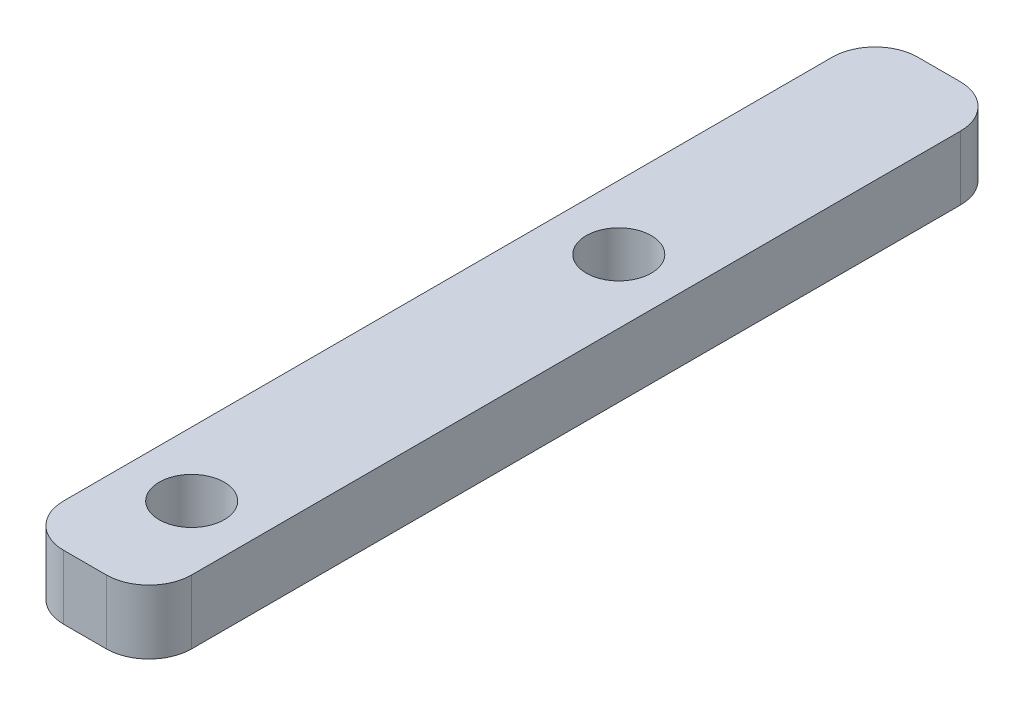
ISO-10303-21;
HEADER;
FILE_DESCRIPTION(('STEP AP214'),'2;1');
FILE_NAME('part.step','',(''),(''),'','','');
FILE_SCHEMA(('AUTOMOTIVE_DESIGN { 1 0 10303 214 1 1 1 1 }'));
ENDSEC;
DATA;
#1=APPLICATION_CONTEXT('core data for automotive mechanical design processes');
#2=APPLICATION_PROTOCOL_DEFINITION('international standard','automotive_design',2000,#1);
#3=PRODUCT_CONTEXT('',#1,'mechanical');
#4=PRODUCT('Part','Part','',(#3));
#5=PRODUCT_RELATED_PRODUCT_CATEGORY('part','',(#4));
#6=PRODUCT_DEFINITION_FORMATION('','',#4);
#7=PRODUCT_DEFINITION_CONTEXT('part definition',#1,'design');
#8=PRODUCT_DEFINITION('design','',#6,#7);
#9=PRODUCT_DEFINITION_SHAPE('','',#8);
#10=(LENGTH_UNIT() NAMED_UNIT(*) SI_UNIT(.MILLI.,.METRE.));
#11=(NAMED_UNIT(*) PLANE_ANGLE_UNIT() SI_UNIT($,.RADIAN.));
#12=(NAMED_UNIT(*) SI_UNIT($,.STERADIAN.) SOLID_ANGLE_UNIT());
#13=UNCERTAINTY_MEASURE_WITH_UNIT(LENGTH_MEASURE(1.E-05),#10,'distance_accuracy_value','');
#14=(GEOMETRIC_REPRESENTATION_CONTEXT(3) GLOBAL_UNCERTAINTY_ASSIGNED_CONTEXT((#13)) GLOBAL_UNIT_ASSIGNED_CONTEXT((#10,
#11,#12)) REPRESENTATION_CONTEXT('',''));
#15=CARTESIAN_POINT('',(0.,0.,0.));
#16=DIRECTION('',(0.,0.,1.));
#17=DIRECTION('',(1.,0.,0.));
#18=AXIS2_PLACEMENT_3D('',#15,#16,#17);
#19=CARTESIAN_POINT('',(3.,3.,20.));
#20=DIRECTION('',(-1.,0.,0.));
#21=DIRECTION('',(0.,0.,1.));
#22=AXIS2_PLACEMENT_3D('',#19,#20,#21);
#23=PLANE('',#22);
#24=DIRECTION('',(0.,0.,-1.));
#25=VECTOR('',#24,1.);
#26=CARTESIAN_POINT('',(3.,0.,20.));
#27=LINE('',#26,#25);
#28=CARTESIAN_POINT('',(3.,0.,18.));
#29=VERTEX_POINT('',#28);
#30=CARTESIAN_POINT('',(3.,0.,-18.));
#31=VERTEX_POINT('',#30);
#32=EDGE_CURVE('E159',#29,#31,#27,.T.);
#33=ORIENTED_EDGE('',*,*,#32,.T.);
#34=DIRECTION('',(0.,-1.,0.));
#35=VECTOR('',#34,1.);
#36=CARTESIAN_POINT('',(3.,3.,-18.));
#37=LINE('',#36,#35);
#38=CARTESIAN_POINT('',(3.,3.,-18.));
#39=VERTEX_POINT('',#38);
#40=EDGE_CURVE('E11',#31,#39,#37,.F.);
#41=ORIENTED_EDGE('',*,*,#40,.T.);
#42=DIRECTION('',(0.,0.,-1.));
#43=VECTOR('',#42,1.);
#44=CARTESIAN_POINT('',(3.,3.,20.));
#45=LINE('',#44,#43);
#46=CARTESIAN_POINT('',(3.,3.,18.));
#47=VERTEX_POINT('',#46);
#48=EDGE_CURVE('E127',#47,#39,#45,.T.);
#49=ORIENTED_EDGE('',*,*,#48,.F.);
#50=DIRECTION('',(0.,-1.,0.));
#51=VECTOR('',#50,1.);
#52=CARTESIAN_POINT('',(3.,3.,18.));
#53=LINE('',#52,#51);
#54=EDGE_CURVE('E43',#47,#29,#53,.T.);
#55=ORIENTED_EDGE('',*,*,#54,.T.);
#56=EDGE_LOOP('',(#33,#41,#49,#55));
#57=FACE_BOUND('',#56,.T.);
#58=ADVANCED_FACE('F35',(#57),#23,.F.);
#59=CARTESIAN_POINT('',(-3.,3.,-20.));
#60=DIRECTION('',(0.,0.,1.));
#61=DIRECTION('',(1.,0.,0.));
#62=AXIS2_PLACEMENT_3D('',#59,#60,#61);
#63=PLANE('',#62);
#64=DIRECTION('',(-1.,0.,0.));
#65=VECTOR('',#64,1.);
#66=CARTESIAN_POINT('',(-3.,0.,-20.));
#67=LINE('',#66,#65);
#68=CARTESIAN_POINT('',(1.,0.,-20.));
#69=VERTEX_POINT('',#68);
#70=CARTESIAN_POINT('',(-0.999999999999999,0.,-20.));
#71=VERTEX_POINT('',#70);
#72=EDGE_CURVE('E132',#69,#71,#67,.T.);
#73=ORIENTED_EDGE('',*,*,#72,.T.);
#74=DIRECTION('',(0.,-1.,0.));
#75=VECTOR('',#74,1.);
#76=CARTESIAN_POINT('',(-0.999999999999999,3.,-20.));
#77=LINE('',#76,#75);
#78=CARTESIAN_POINT('',(-0.999999999999999,3.,-20.));
#79=VERTEX_POINT('',#78);
#80=EDGE_CURVE('E50',#71,#79,#77,.F.);
#81=ORIENTED_EDGE('',*,*,#80,.T.);
#82=DIRECTION('',(-1.,0.,0.));
#83=VECTOR('',#82,1.);
#84=CARTESIAN_POINT('',(-3.,3.,-20.));
#85=LINE('',#84,#83);
#86=CARTESIAN_POINT('',(1.,3.,-20.));
#87=VERTEX_POINT('',#86);
#88=EDGE_CURVE('E130',#87,#79,#85,.T.);
#89=ORIENTED_EDGE('',*,*,#88,.F.);
#90=DIRECTION('',(0.,-1.,0.));
#91=VECTOR('',#90,1.);
#92=CARTESIAN_POINT('',(1.,3.,-20.));
#93=LINE('',#92,#91);
#94=EDGE_CURVE('E151',#87,#69,#93,.T.);
#95=ORIENTED_EDGE('',*,*,#94,.T.);
#96=EDGE_LOOP('',(#73,#81,#89,#95));
#97=FACE_BOUND('',#96,.T.);
#98=ADVANCED_FACE('F198',(#97),#63,.F.);
#99=CARTESIAN_POINT('',(-3.,3.,20.));
#100=DIRECTION('',(1.,0.,0.));
#101=DIRECTION('',(0.,0.,-1.));
#102=AXIS2_PLACEMENT_3D('',#99,#100,#101);
#103=PLANE('',#102);
#104=DIRECTION('',(0.,0.,1.));
#105=VECTOR('',#104,1.);
#106=CARTESIAN_POINT('',(-3.,0.,20.));
#107=LINE('',#106,#105);
#108=CARTESIAN_POINT('',(-3.,0.,-18.));
#109=VERTEX_POINT('',#108);
#110=CARTESIAN_POINT('',(-3.,0.,18.));
#111=VERTEX_POINT('',#110);
#112=EDGE_CURVE('E128',#109,#111,#107,.T.);
#113=ORIENTED_EDGE('',*,*,#112,.T.);
#114=DIRECTION('',(0.,-1.,0.));
#115=VECTOR('',#114,1.);
#116=CARTESIAN_POINT('',(-3.,3.,18.));
#117=LINE('',#116,#115);
#118=CARTESIAN_POINT('',(-3.,3.,18.));
#119=VERTEX_POINT('',#118);
#120=EDGE_CURVE('E106',#111,#119,#117,.F.);
#121=ORIENTED_EDGE('',*,*,#120,.T.);
#122=DIRECTION('',(0.,0.,1.));
#123=VECTOR('',#122,1.);
#124=CARTESIAN_POINT('',(-3.,3.,20.));
#125=LINE('',#124,#123);
#126=CARTESIAN_POINT('',(-3.,3.,-18.));
#127=VERTEX_POINT('',#126);
#128=EDGE_CURVE('E171',#127,#119,#125,.T.);
#129=ORIENTED_EDGE('',*,*,#128,.F.);
#130=DIRECTION('',(0.,-1.,0.));
#131=VECTOR('',#130,1.);
#132=CARTESIAN_POINT('',(-3.,3.,-18.));
#133=LINE('',#132,#131);
#134=EDGE_CURVE('E111',#127,#109,#133,.T.);
#135=ORIENTED_EDGE('',*,*,#134,.T.);
#136=EDGE_LOOP('',(#113,#121,#129,#135));
#137=FACE_BOUND('',#136,.T.);
#138=ADVANCED_FACE('F195',(#137),#103,.F.);
#139=CARTESIAN_POINT('',(-3.,3.,20.));
#140=DIRECTION('',(0.,0.,-1.));
#141=DIRECTION('',(-1.,0.,0.));
#142=AXIS2_PLACEMENT_3D('',#139,#140,#141);
#143=PLANE('',#142);
#144=DIRECTION('',(1.,0.,0.));
#145=VECTOR('',#144,1.);
#146=CARTESIAN_POINT('',(-3.,3.,20.));
#147=LINE('',#146,#145);
#148=CARTESIAN_POINT('',(-0.999999999999999,3.,20.));
#149=VERTEX_POINT('',#148);
#150=CARTESIAN_POINT('',(1.,3.,20.));
#151=VERTEX_POINT('',#150);
#152=EDGE_CURVE('E121',#149,#151,#147,.T.);
#153=ORIENTED_EDGE('',*,*,#152,.F.);
#154=DIRECTION('',(0.,-1.,0.));
#155=VECTOR('',#154,1.);
#156=CARTESIAN_POINT('',(-0.999999999999999,3.,20.));
#157=LINE('',#156,#155);
#158=CARTESIAN_POINT('',(-0.999999999999999,0.,20.));
#159=VERTEX_POINT('',#158);
#160=EDGE_CURVE('E105',#149,#159,#157,.T.);
#161=ORIENTED_EDGE('',*,*,#160,.T.);
#162=DIRECTION('',(1.,0.,0.));
#163=VECTOR('',#162,1.);
#164=CARTESIAN_POINT('',(-3.,0.,20.));
#165=LINE('',#164,#163);
#166=CARTESIAN_POINT('',(1.,0.,20.));
#167=VERTEX_POINT('',#166);
#168=EDGE_CURVE('E118',#159,#167,#165,.T.);
#169=ORIENTED_EDGE('',*,*,#168,.T.);
#170=DIRECTION('',(0.,-1.,0.));
#171=VECTOR('',#170,1.);
#172=CARTESIAN_POINT('',(1.,3.,20.));
#173=LINE('',#172,#171);
#174=EDGE_CURVE('E123',#167,#151,#173,.F.);
#175=ORIENTED_EDGE('',*,*,#174,.T.);
#176=EDGE_LOOP('',(#153,#161,#169,#175));
#177=FACE_BOUND('',#176,.T.);
#178=ADVANCED_FACE('F117',(#177),#143,.F.);
#179=CARTESIAN_POINT('',(0.,3.,0.));
#180=DIRECTION('',(0.,-1.,0.));
#181=DIRECTION('',(0.,0.,-1.));
#182=AXIS2_PLACEMENT_3D('',#179,#180,#181);
#183=PLANE('',#182);
#184=CARTESIAN_POINT('',(0.,3.,-5.));
#185=DIRECTION('',(0.,1.,0.));
#186=DIRECTION('',(0.,0.,1.));
#187=AXIS2_PLACEMENT_3D('',#184,#185,#186);
#188=CIRCLE('',#187,1.525);
#189=CARTESIAN_POINT('',(0.,3.,-3.475));
#190=VERTEX_POINT('',#189);
#191=EDGE_CURVE('E167',#190,#190,#188,.T.);
#192=ORIENTED_EDGE('',*,*,#191,.F.);
#193=EDGE_LOOP('',(#192));
#194=FACE_BOUND('',#193,.T.);
#195=CARTESIAN_POINT('',(0.,3.,15.));
#196=DIRECTION('',(0.,1.,0.));
#197=DIRECTION('',(0.,0.,1.));
#198=AXIS2_PLACEMENT_3D('',#195,#196,#197);
#199=CIRCLE('',#198,1.525);
#200=CARTESIAN_POINT('',(0.,3.,16.525));
#201=VERTEX_POINT('',#200);
#202=EDGE_CURVE('E175',#201,#201,#199,.T.);
#203=ORIENTED_EDGE('',*,*,#202,.F.);
#204=EDGE_LOOP('',(#203));
#205=FACE_BOUND('',#204,.T.);
#206=ORIENTED_EDGE('',*,*,#128,.T.);
#207=CARTESIAN_POINT('',(-0.999999999999999,3.,18.));
#208=DIRECTION('',(0.,-1.,0.));
#209=DIRECTION('',(0.,0.,-1.));
#210=AXIS2_PLACEMENT_3D('',#207,#208,#209);
#211=CIRCLE('',#210,2.);
#212=EDGE_CURVE('E149',#119,#149,#211,.F.);
#213=ORIENTED_EDGE('',*,*,#212,.T.);
#214=ORIENTED_EDGE('',*,*,#152,.T.);
#215=CARTESIAN_POINT('',(1.,3.,18.));
#216=DIRECTION('',(0.,-1.,0.));
#217=DIRECTION('',(0.,0.,-1.));
#218=AXIS2_PLACEMENT_3D('',#215,#216,#217);
#219=CIRCLE('',#218,2.);
#220=EDGE_CURVE('E144',#151,#47,#219,.F.);
#221=ORIENTED_EDGE('',*,*,#220,.T.);
#222=ORIENTED_EDGE('',*,*,#48,.T.);
#223=CARTESIAN_POINT('',(1.,3.,-18.));
#224=DIRECTION('',(0.,-1.,0.));
#225=DIRECTION('',(0.,0.,-1.));
#226=AXIS2_PLACEMENT_3D('',#223,#224,#225);
#227=CIRCLE('',#226,2.);
#228=EDGE_CURVE('E57',#39,#87,#227,.F.);
#229=ORIENTED_EDGE('',*,*,#228,.T.);
#230=ORIENTED_EDGE('',*,*,#88,.T.);
#231=CARTESIAN_POINT('',(-0.999999999999999,3.,-18.));
#232=DIRECTION('',(0.,-1.,0.));
#233=DIRECTION('',(0.,0.,-1.));
#234=AXIS2_PLACEMENT_3D('',#231,#232,#233);
#235=CIRCLE('',#234,2.);
#236=EDGE_CURVE('E147',#79,#127,#235,.F.);
#237=ORIENTED_EDGE('',*,*,#236,.T.);
#238=EDGE_LOOP('',(#206,#213,#214,#221,#222,#229,#230,#237));
#239=FACE_BOUND('',#238,.T.);
#240=ADVANCED_FACE('F186',(#194,#205,#239),#183,.F.);
#241=CARTESIAN_POINT('',(0.,0.,0.));
#242=DIRECTION('',(0.,-1.,0.));
#243=DIRECTION('',(0.,0.,-1.));
#244=AXIS2_PLACEMENT_3D('',#241,#242,#243);
#245=PLANE('',#244);
#246=CARTESIAN_POINT('',(0.,0.,-5.));
#247=DIRECTION('',(0.,1.,0.));
#248=DIRECTION('',(0.,0.,1.));
#249=AXIS2_PLACEMENT_3D('',#246,#247,#248);
#250=CIRCLE('',#249,1.525);
#251=CARTESIAN_POINT('',(0.,0.,-3.475));
#252=VERTEX_POINT('',#251);
#253=EDGE_CURVE('E164',#252,#252,#250,.T.);
#254=ORIENTED_EDGE('',*,*,#253,.T.);
#255=EDGE_LOOP('',(#254));
#256=FACE_BOUND('',#255,.T.);
#257=CARTESIAN_POINT('',(0.,0.,15.));
#258=DIRECTION('',(0.,1.,0.));
#259=DIRECTION('',(0.,0.,1.));
#260=AXIS2_PLACEMENT_3D('',#257,#258,#259);
#261=CIRCLE('',#260,1.525);
#262=CARTESIAN_POINT('',(0.,0.,16.525));
#263=VERTEX_POINT('',#262);
#264=EDGE_CURVE('E178',#263,#263,#261,.T.);
#265=ORIENTED_EDGE('',*,*,#264,.T.);
#266=EDGE_LOOP('',(#265));
#267=FACE_BOUND('',#266,.T.);
#268=ORIENTED_EDGE('',*,*,#168,.F.);
#269=CARTESIAN_POINT('',(-0.999999999999999,0.,18.));
#270=DIRECTION('',(0.,-1.,0.));
#271=DIRECTION('',(0.,0.,-1.));
#272=AXIS2_PLACEMENT_3D('',#269,#270,#271);
#273=CIRCLE('',#272,2.);
#274=EDGE_CURVE('E101',#159,#111,#273,.T.);
#275=ORIENTED_EDGE('',*,*,#274,.T.);
#276=ORIENTED_EDGE('',*,*,#112,.F.);
#277=CARTESIAN_POINT('',(-0.999999999999999,0.,-18.));
#278=DIRECTION('',(0.,-1.,0.));
#279=DIRECTION('',(0.,0.,-1.));
#280=AXIS2_PLACEMENT_3D('',#277,#278,#279);
#281=CIRCLE('',#280,2.);
#282=EDGE_CURVE('E112',#109,#71,#281,.T.);
#283=ORIENTED_EDGE('',*,*,#282,.T.);
#284=ORIENTED_EDGE('',*,*,#72,.F.);
#285=CARTESIAN_POINT('',(1.,0.,-18.));
#286=DIRECTION('',(0.,-1.,0.));
#287=DIRECTION('',(0.,0.,-1.));
#288=AXIS2_PLACEMENT_3D('',#285,#286,#287);
#289=CIRCLE('',#288,2.);
#290=EDGE_CURVE('E138',#69,#31,#289,.T.);
#291=ORIENTED_EDGE('',*,*,#290,.T.);
#292=ORIENTED_EDGE('',*,*,#32,.F.);
#293=CARTESIAN_POINT('',(1.,0.,18.));
#294=DIRECTION('',(0.,-1.,0.));
#295=DIRECTION('',(0.,0.,-1.));
#296=AXIS2_PLACEMENT_3D('',#293,#294,#295);
#297=CIRCLE('',#296,2.);
#298=EDGE_CURVE('E122',#29,#167,#297,.T.);
#299=ORIENTED_EDGE('',*,*,#298,.T.);
#300=EDGE_LOOP('',(#268,#275,#276,#283,#284,#291,#292,#299));
#301=FACE_BOUND('',#300,.T.);
#302=ADVANCED_FACE('F125',(#256,#267,#301),#245,.T.);
#303=CARTESIAN_POINT('',(-0.999999999999999,3.,18.));
#304=DIRECTION('',(0.,-1.,0.));
#305=DIRECTION('',(0.,0.,-1.));
#306=AXIS2_PLACEMENT_3D('',#303,#304,#305);
#307=CYLINDRICAL_SURFACE('',#306,2.);
#308=ORIENTED_EDGE('',*,*,#212,.F.);
#309=ORIENTED_EDGE('',*,*,#120,.F.);
#310=ORIENTED_EDGE('',*,*,#274,.F.);
#311=ORIENTED_EDGE('',*,*,#160,.F.);
#312=EDGE_LOOP('',(#308,#309,#310,#311));
#313=FACE_BOUND('',#312,.T.);
#314=ADVANCED_FACE('F104',(#313),#307,.T.);
#315=CARTESIAN_POINT('',(-0.999999999999999,3.,-18.));
#316=DIRECTION('',(0.,-1.,0.));
#317=DIRECTION('',(0.,0.,-1.));
#318=AXIS2_PLACEMENT_3D('',#315,#316,#317);
#319=CYLINDRICAL_SURFACE('',#318,2.);
#320=ORIENTED_EDGE('',*,*,#236,.F.);
#321=ORIENTED_EDGE('',*,*,#80,.F.);
#322=ORIENTED_EDGE('',*,*,#282,.F.);
#323=ORIENTED_EDGE('',*,*,#134,.F.);
#324=EDGE_LOOP('',(#320,#321,#322,#323));
#325=FACE_BOUND('',#324,.T.);
#326=ADVANCED_FACE('F197',(#325),#319,.T.);
#327=CARTESIAN_POINT('',(1.,3.,-18.));
#328=DIRECTION('',(0.,-1.,0.));
#329=DIRECTION('',(0.,0.,-1.));
#330=AXIS2_PLACEMENT_3D('',#327,#328,#329);
#331=CYLINDRICAL_SURFACE('',#330,2.);
#332=ORIENTED_EDGE('',*,*,#228,.F.);
#333=ORIENTED_EDGE('',*,*,#40,.F.);
#334=ORIENTED_EDGE('',*,*,#290,.F.);
#335=ORIENTED_EDGE('',*,*,#94,.F.);
#336=EDGE_LOOP('',(#332,#333,#334,#335));
#337=FACE_BOUND('',#336,.T.);
#338=ADVANCED_FACE('F201',(#337),#331,.T.);
#339=CARTESIAN_POINT('',(1.,3.,18.));
#340=DIRECTION('',(0.,-1.,0.));
#341=DIRECTION('',(0.,0.,-1.));
#342=AXIS2_PLACEMENT_3D('',#339,#340,#341);
#343=CYLINDRICAL_SURFACE('',#342,2.);
#344=ORIENTED_EDGE('',*,*,#220,.F.);
#345=ORIENTED_EDGE('',*,*,#174,.F.);
#346=ORIENTED_EDGE('',*,*,#298,.F.);
#347=ORIENTED_EDGE('',*,*,#54,.F.);
#348=EDGE_LOOP('',(#344,#345,#346,#347));
#349=FACE_BOUND('',#348,.T.);
#350=ADVANCED_FACE('F37',(#349),#343,.T.);
#351=CARTESIAN_POINT('',(0.,0.,15.));
#352=DIRECTION('',(0.,1.,0.));
#353=DIRECTION('',(0.,0.,1.));
#354=AXIS2_PLACEMENT_3D('',#351,#352,#353);
#355=CYLINDRICAL_SURFACE('',#354,1.525);
#356=ORIENTED_EDGE('',*,*,#264,.F.);
#357=EDGE_LOOP('',(#356));
#358=FACE_BOUND('',#357,.T.);
#359=ORIENTED_EDGE('',*,*,#202,.T.);
#360=EDGE_LOOP('',(#359));
#361=FACE_BOUND('',#360,.T.);
#362=ADVANCED_FACE('F203',(#358,#361),#355,.F.);
#363=CARTESIAN_POINT('',(0.,0.,-5.));
#364=DIRECTION('',(0.,1.,0.));
#365=DIRECTION('',(0.,0.,1.));
#366=AXIS2_PLACEMENT_3D('',#363,#364,#365);
#367=CYLINDRICAL_SURFACE('',#366,1.525);
#368=ORIENTED_EDGE('',*,*,#253,.F.);
#369=EDGE_LOOP('',(#368));
#370=FACE_BOUND('',#369,.T.);
#371=ORIENTED_EDGE('',*,*,#191,.T.);
#372=EDGE_LOOP('',(#371));
#373=FACE_BOUND('',#372,.T.);
#374=ADVANCED_FACE('F184',(#370,#373),#367,.F.);
#375=CLOSED_SHELL('',(#58,#98,#138,#178,#240,#302,#314,#326,#338,#350,#362,#374));
#376=MANIFOLD_SOLID_BREP('B2',#375);
#377=ADVANCED_BREP_SHAPE_REPRESENTATION('',(#18,#376),#14);
#378=SHAPE_DEFINITION_REPRESENTATION(#9,#377);
ENDSEC;
END-ISO-10303-21;
